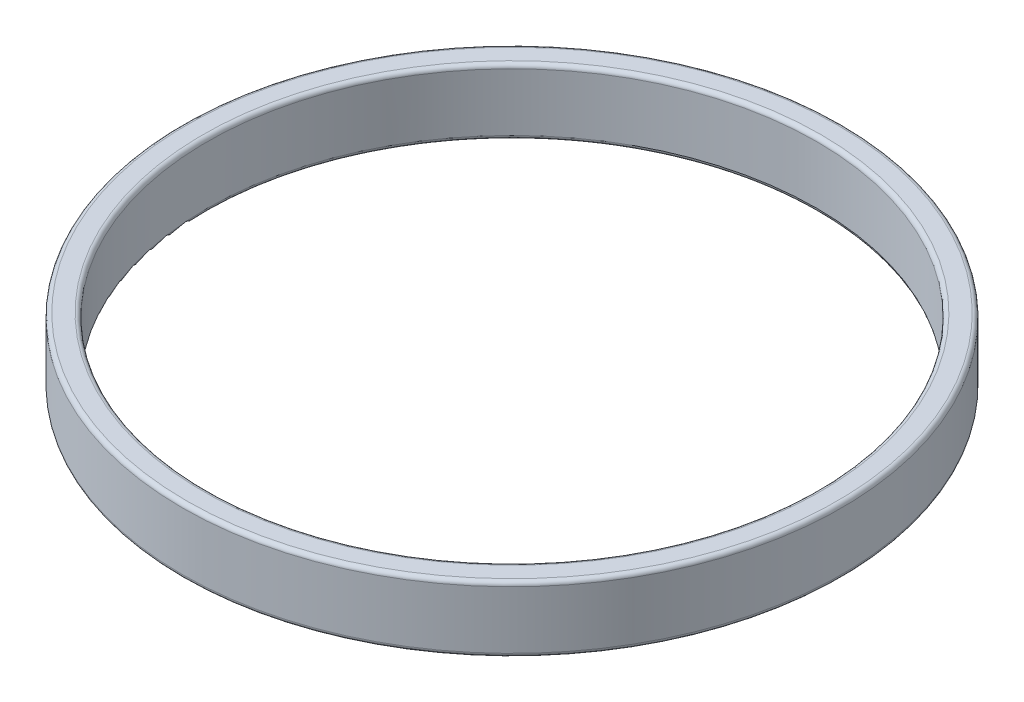
ISO-10303-21;
HEADER;
FILE_DESCRIPTION(('STEP AP214'),'2;1');
FILE_NAME('part.step','',(''),(''),'','','');
FILE_SCHEMA(('AUTOMOTIVE_DESIGN { 1 0 10303 214 1 1 1 1 }'));
ENDSEC;
DATA;
#1=APPLICATION_CONTEXT('core data for automotive mechanical design processes');
#2=APPLICATION_PROTOCOL_DEFINITION('international standard','automotive_design',2000,#1);
#3=PRODUCT_CONTEXT('',#1,'mechanical');
#4=PRODUCT('Part','Part','',(#3));
#5=PRODUCT_RELATED_PRODUCT_CATEGORY('part','',(#4));
#6=PRODUCT_DEFINITION_FORMATION('','',#4);
#7=PRODUCT_DEFINITION_CONTEXT('part definition',#1,'design');
#8=PRODUCT_DEFINITION('design','',#6,#7);
#9=PRODUCT_DEFINITION_SHAPE('','',#8);
#10=(LENGTH_UNIT() NAMED_UNIT(*) SI_UNIT(.MILLI.,.METRE.));
#11=(NAMED_UNIT(*) PLANE_ANGLE_UNIT() SI_UNIT($,.RADIAN.));
#12=(NAMED_UNIT(*) SI_UNIT($,.STERADIAN.) SOLID_ANGLE_UNIT());
#13=UNCERTAINTY_MEASURE_WITH_UNIT(LENGTH_MEASURE(1.E-05),#10,'distance_accuracy_value','');
#14=(GEOMETRIC_REPRESENTATION_CONTEXT(3) GLOBAL_UNCERTAINTY_ASSIGNED_CONTEXT((#13)) GLOBAL_UNIT_ASSIGNED_CONTEXT((#10,
#11,#12)) REPRESENTATION_CONTEXT('',''));
#15=CARTESIAN_POINT('',(0.,0.,0.));
#16=DIRECTION('',(0.,0.,1.));
#17=DIRECTION('',(1.,0.,0.));
#18=AXIS2_PLACEMENT_3D('',#15,#16,#17);
#19=CARTESIAN_POINT('',(0.,0.,0.));
#20=DIRECTION('',(0.,-1.,0.));
#21=DIRECTION('',(0.,0.,-1.));
#22=AXIS2_PLACEMENT_3D('',#19,#20,#21);
#23=CYLINDRICAL_SURFACE('',#22,20.);
#24=CARTESIAN_POINT('',(0.,-1.75,0.));
#25=DIRECTION('',(0.,1.,0.));
#26=DIRECTION('',(0.,0.,1.));
#27=AXIS2_PLACEMENT_3D('',#24,#25,#26);
#28=CIRCLE('',#27,20.);
#29=CARTESIAN_POINT('',(0.,-1.75,20.));
#30=VERTEX_POINT('',#29);
#31=EDGE_CURVE('E40',#30,#30,#28,.T.);
#32=ORIENTED_EDGE('',*,*,#31,.T.);
#33=EDGE_LOOP('',(#32));
#34=FACE_BOUND('',#33,.T.);
#35=CARTESIAN_POINT('',(0.,1.75,0.));
#36=DIRECTION('',(0.,-1.,0.));
#37=DIRECTION('',(0.,0.,-1.));
#38=AXIS2_PLACEMENT_3D('',#35,#36,#37);
#39=CIRCLE('',#38,20.);
#40=CARTESIAN_POINT('',(0.,1.75,-20.));
#41=VERTEX_POINT('',#40);
#42=EDGE_CURVE('E44',#41,#41,#39,.T.);
#43=ORIENTED_EDGE('',*,*,#42,.T.);
#44=EDGE_LOOP('',(#43));
#45=FACE_BOUND('',#44,.T.);
#46=ADVANCED_FACE('F29',(#34,#45),#23,.T.);
#47=CARTESIAN_POINT('',(-20.,-2.,0.));
#48=DIRECTION('',(0.,1.,0.));
#49=DIRECTION('',(0.,0.,1.));
#50=AXIS2_PLACEMENT_3D('',#47,#48,#49);
#51=PLANE('',#50);
#52=CARTESIAN_POINT('',(0.,-2.,0.));
#53=DIRECTION('',(0.,1.,0.));
#54=DIRECTION('',(0.,0.,1.));
#55=AXIS2_PLACEMENT_3D('',#52,#53,#54);
#56=CIRCLE('',#55,18.75);
#57=CARTESIAN_POINT('',(0.,-2.,18.75));
#58=VERTEX_POINT('',#57);
#59=EDGE_CURVE('E49',#58,#58,#56,.T.);
#60=ORIENTED_EDGE('',*,*,#59,.T.);
#61=EDGE_LOOP('',(#60));
#62=FACE_BOUND('',#61,.T.);
#63=CARTESIAN_POINT('',(0.,-2.,0.));
#64=DIRECTION('',(0.,1.,0.));
#65=DIRECTION('',(0.,0.,1.));
#66=AXIS2_PLACEMENT_3D('',#63,#64,#65);
#67=CIRCLE('',#66,19.75);
#68=CARTESIAN_POINT('',(0.,-2.,19.75));
#69=VERTEX_POINT('',#68);
#70=EDGE_CURVE('E52',#69,#69,#67,.F.);
#71=ORIENTED_EDGE('',*,*,#70,.T.);
#72=EDGE_LOOP('',(#71));
#73=FACE_BOUND('',#72,.T.);
#74=ADVANCED_FACE('F73',(#62,#73),#51,.F.);
#75=CARTESIAN_POINT('',(0.,0.,0.));
#76=DIRECTION('',(0.,-1.,0.));
#77=DIRECTION('',(0.,0.,-1.));
#78=AXIS2_PLACEMENT_3D('',#75,#76,#77);
#79=CYLINDRICAL_SURFACE('',#78,18.5);
#80=CARTESIAN_POINT('',(0.,-1.75,0.));
#81=DIRECTION('',(0.,1.,0.));
#82=DIRECTION('',(0.,0.,1.));
#83=AXIS2_PLACEMENT_3D('',#80,#81,#82);
#84=CIRCLE('',#83,18.5);
#85=CARTESIAN_POINT('',(0.,-1.75,18.5));
#86=VERTEX_POINT('',#85);
#87=EDGE_CURVE('E55',#86,#86,#84,.F.);
#88=ORIENTED_EDGE('',*,*,#87,.T.);
#89=EDGE_LOOP('',(#88));
#90=FACE_BOUND('',#89,.T.);
#91=CARTESIAN_POINT('',(0.,1.75,0.));
#92=DIRECTION('',(0.,-1.,0.));
#93=DIRECTION('',(0.,0.,-1.));
#94=AXIS2_PLACEMENT_3D('',#91,#92,#93);
#95=CIRCLE('',#94,18.5);
#96=CARTESIAN_POINT('',(0.,1.75,-18.5));
#97=VERTEX_POINT('',#96);
#98=EDGE_CURVE('E58',#97,#97,#95,.F.);
#99=ORIENTED_EDGE('',*,*,#98,.T.);
#100=EDGE_LOOP('',(#99));
#101=FACE_BOUND('',#100,.T.);
#102=ADVANCED_FACE('F62',(#90,#101),#79,.F.);
#103=CARTESIAN_POINT('',(-20.,2.,0.));
#104=DIRECTION('',(0.,-1.,0.));
#105=DIRECTION('',(0.,0.,-1.));
#106=AXIS2_PLACEMENT_3D('',#103,#104,#105);
#107=PLANE('',#106);
#108=CARTESIAN_POINT('',(0.,2.,0.));
#109=DIRECTION('',(0.,-1.,0.));
#110=DIRECTION('',(0.,0.,-1.));
#111=AXIS2_PLACEMENT_3D('',#108,#109,#110);
#112=CIRCLE('',#111,19.75);
#113=CARTESIAN_POINT('',(0.,2.,-19.75));
#114=VERTEX_POINT('',#113);
#115=EDGE_CURVE('E10',#114,#114,#112,.F.);
#116=ORIENTED_EDGE('',*,*,#115,.T.);
#117=EDGE_LOOP('',(#116));
#118=FACE_BOUND('',#117,.T.);
#119=CARTESIAN_POINT('',(0.,2.,0.));
#120=DIRECTION('',(0.,-1.,0.));
#121=DIRECTION('',(0.,0.,-1.));
#122=AXIS2_PLACEMENT_3D('',#119,#120,#121);
#123=CIRCLE('',#122,18.75);
#124=CARTESIAN_POINT('',(0.,2.,-18.75));
#125=VERTEX_POINT('',#124);
#126=EDGE_CURVE('E36',#125,#125,#123,.T.);
#127=ORIENTED_EDGE('',*,*,#126,.T.);
#128=EDGE_LOOP('',(#127));
#129=FACE_BOUND('',#128,.T.);
#130=ADVANCED_FACE('F87',(#118,#129),#107,.F.);
#131=CARTESIAN_POINT('',(0.,-1.75,0.));
#132=DIRECTION('',(0.,1.,0.));
#133=DIRECTION('',(0.,0.,1.));
#134=AXIS2_PLACEMENT_3D('',#131,#132,#133);
#135=TOROIDAL_SURFACE('',#134,18.75,0.25);
#136=ORIENTED_EDGE('',*,*,#59,.F.);
#137=EDGE_LOOP('',(#136));
#138=FACE_BOUND('',#137,.T.);
#139=ORIENTED_EDGE('',*,*,#87,.F.);
#140=EDGE_LOOP('',(#139));
#141=FACE_BOUND('',#140,.T.);
#142=ADVANCED_FACE('F84',(#138,#141),#135,.T.);
#143=CARTESIAN_POINT('',(0.,-1.75,0.));
#144=DIRECTION('',(0.,1.,0.));
#145=DIRECTION('',(0.,0.,1.));
#146=AXIS2_PLACEMENT_3D('',#143,#144,#145);
#147=TOROIDAL_SURFACE('',#146,19.75,0.25);
#148=ORIENTED_EDGE('',*,*,#31,.F.);
#149=EDGE_LOOP('',(#148));
#150=FACE_BOUND('',#149,.T.);
#151=ORIENTED_EDGE('',*,*,#70,.F.);
#152=EDGE_LOOP('',(#151));
#153=FACE_BOUND('',#152,.T.);
#154=ADVANCED_FACE('F70',(#150,#153),#147,.T.);
#155=CARTESIAN_POINT('',(0.,1.75,0.));
#156=DIRECTION('',(0.,-1.,0.));
#157=DIRECTION('',(0.,0.,-1.));
#158=AXIS2_PLACEMENT_3D('',#155,#156,#157);
#159=TOROIDAL_SURFACE('',#158,19.75,0.25);
#160=ORIENTED_EDGE('',*,*,#115,.F.);
#161=EDGE_LOOP('',(#160));
#162=FACE_BOUND('',#161,.T.);
#163=ORIENTED_EDGE('',*,*,#42,.F.);
#164=EDGE_LOOP('',(#163));
#165=FACE_BOUND('',#164,.T.);
#166=ADVANCED_FACE('F66',(#162,#165),#159,.T.);
#167=CARTESIAN_POINT('',(0.,1.75,0.));
#168=DIRECTION('',(0.,-1.,0.));
#169=DIRECTION('',(0.,0.,-1.));
#170=AXIS2_PLACEMENT_3D('',#167,#168,#169);
#171=TOROIDAL_SURFACE('',#170,18.75,0.25);
#172=ORIENTED_EDGE('',*,*,#98,.F.);
#173=EDGE_LOOP('',(#172));
#174=FACE_BOUND('',#173,.T.);
#175=ORIENTED_EDGE('',*,*,#126,.F.);
#176=EDGE_LOOP('',(#175));
#177=FACE_BOUND('',#176,.T.);
#178=ADVANCED_FACE('F31',(#174,#177),#171,.T.);
#179=CLOSED_SHELL('',(#46,#74,#102,#130,#142,#154,#166,#178));
#180=MANIFOLD_SOLID_BREP('B2',#179);
#181=ADVANCED_BREP_SHAPE_REPRESENTATION('',(#18,#180),#14);
#182=SHAPE_DEFINITION_REPRESENTATION(#9,#181);
ENDSEC;
END-ISO-10303-21;
